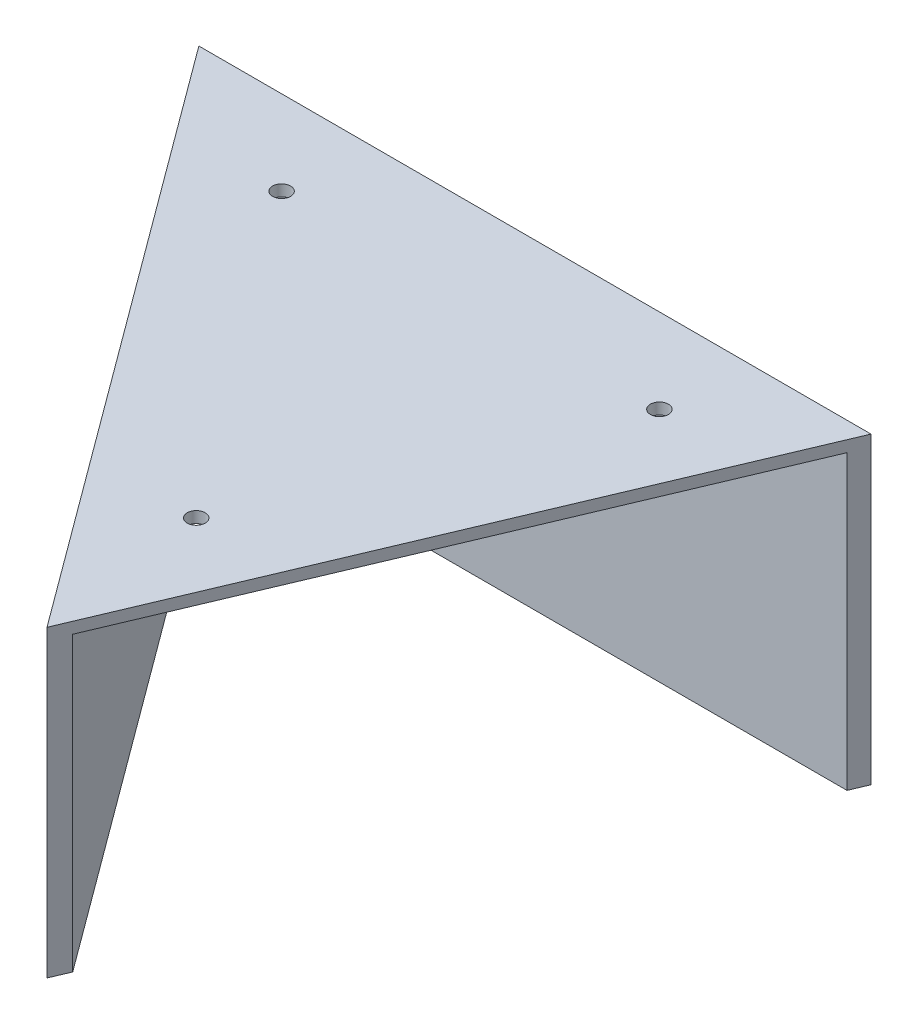
ISO-10303-21;
HEADER;
FILE_DESCRIPTION(('STEP AP214'),'2;1');
FILE_NAME('part.step','',(''),(''),'','','');
FILE_SCHEMA(('AUTOMOTIVE_DESIGN { 1 0 10303 214 1 1 1 1 }'));
ENDSEC;
DATA;
#1=APPLICATION_CONTEXT('core data for automotive mechanical design processes');
#2=APPLICATION_PROTOCOL_DEFINITION('international standard','automotive_design',2000,#1);
#3=PRODUCT_CONTEXT('',#1,'mechanical');
#4=PRODUCT('Part','Part','',(#3));
#5=PRODUCT_RELATED_PRODUCT_CATEGORY('part','',(#4));
#6=PRODUCT_DEFINITION_FORMATION('','',#4);
#7=PRODUCT_DEFINITION_CONTEXT('part definition',#1,'design');
#8=PRODUCT_DEFINITION('design','',#6,#7);
#9=PRODUCT_DEFINITION_SHAPE('','',#8);
#10=(LENGTH_UNIT() NAMED_UNIT(*) SI_UNIT(.MILLI.,.METRE.));
#11=(NAMED_UNIT(*) PLANE_ANGLE_UNIT() SI_UNIT($,.RADIAN.));
#12=(NAMED_UNIT(*) SI_UNIT($,.STERADIAN.) SOLID_ANGLE_UNIT());
#13=UNCERTAINTY_MEASURE_WITH_UNIT(LENGTH_MEASURE(1.E-05),#10,'distance_accuracy_value','');
#14=(GEOMETRIC_REPRESENTATION_CONTEXT(3) GLOBAL_UNCERTAINTY_ASSIGNED_CONTEXT((#13)) GLOBAL_UNIT_ASSIGNED_CONTEXT((#10,
#11,#12)) REPRESENTATION_CONTEXT('',''));
#15=CARTESIAN_POINT('',(0.,0.,0.));
#16=DIRECTION('',(0.,0.,1.));
#17=DIRECTION('',(1.,0.,0.));
#18=AXIS2_PLACEMENT_3D('',#15,#16,#17);
#19=CARTESIAN_POINT('',(6.50000000000002,2.,103.));
#20=DIRECTION('',(-0.921213947184014,0.,-0.389056375752472));
#21=DIRECTION('',(0.389056375752472,0.,-0.921213947184014));
#22=AXIS2_PLACEMENT_3D('',#19,#20,#21);
#23=PLANE('',#22);
#24=DIRECTION('',(0.389056375752472,0.,-0.921213947184014));
#25=VECTOR('',#24,1.);
#26=CARTESIAN_POINT('',(6.50000000000002,-52.,103.));
#27=LINE('',#26,#25);
#28=CARTESIAN_POINT('',(48.7330097087379,-52.,3.00000000000001));
#29=VERTEX_POINT('',#28);
#30=CARTESIAN_POINT('',(50.,-52.,0.));
#31=VERTEX_POINT('',#30);
#32=EDGE_CURVE('E96',#29,#31,#27,.T.);
#33=ORIENTED_EDGE('',*,*,#32,.T.);
#34=DIRECTION('',(0.,-1.,0.));
#35=VECTOR('',#34,1.);
#36=CARTESIAN_POINT('',(50.,2.,0.));
#37=LINE('',#36,#35);
#38=CARTESIAN_POINT('',(50.,2.,0.));
#39=VERTEX_POINT('',#38);
#40=EDGE_CURVE('E11',#39,#31,#37,.T.);
#41=ORIENTED_EDGE('',*,*,#40,.F.);
#42=DIRECTION('',(-0.389056375752472,0.,0.921213947184014));
#43=VECTOR('',#42,1.);
#44=CARTESIAN_POINT('',(6.50000000000002,2.,103.));
#45=LINE('',#44,#43);
#46=CARTESIAN_POINT('',(6.50000000000002,2.,103.));
#47=VERTEX_POINT('',#46);
#48=EDGE_CURVE('E114',#39,#47,#45,.T.);
#49=ORIENTED_EDGE('',*,*,#48,.T.);
#50=DIRECTION('',(0.,-1.,0.));
#51=VECTOR('',#50,1.);
#52=CARTESIAN_POINT('',(6.50000000000002,2.,103.));
#53=LINE('',#52,#51);
#54=CARTESIAN_POINT('',(6.50000000000002,-52.,103.));
#55=VERTEX_POINT('',#54);
#56=EDGE_CURVE('E39',#47,#55,#53,.T.);
#57=ORIENTED_EDGE('',*,*,#56,.T.);
#58=CARTESIAN_POINT('',(7.85715235470182,-52.,99.7865128153039));
#59=VERTEX_POINT('',#58);
#60=EDGE_CURVE('E104',#55,#59,#27,.T.);
#61=ORIENTED_EDGE('',*,*,#60,.T.);
#62=DIRECTION('',(0.,-1.,0.));
#63=VECTOR('',#62,1.);
#64=CARTESIAN_POINT('',(7.8571523547018,2.,99.7865128153038));
#65=LINE('',#64,#63);
#66=CARTESIAN_POINT('',(7.8571523547018,0.,99.7865128153038));
#67=VERTEX_POINT('',#66);
#68=EDGE_CURVE('E130',#67,#59,#65,.T.);
#69=ORIENTED_EDGE('',*,*,#68,.F.);
#70=DIRECTION('',(0.389056375752472,0.,-0.921213947184014));
#71=VECTOR('',#70,1.);
#72=CARTESIAN_POINT('',(6.50000000000002,0.,103.));
#73=LINE('',#72,#71);
#74=CARTESIAN_POINT('',(48.7330097087379,0.,3.00000000000002));
#75=VERTEX_POINT('',#74);
#76=EDGE_CURVE('E99',#67,#75,#73,.T.);
#77=ORIENTED_EDGE('',*,*,#76,.T.);
#78=DIRECTION('',(0.,-1.,0.));
#79=VECTOR('',#78,1.);
#80=CARTESIAN_POINT('',(48.7330097087379,113.00308109224,3.00000000000001));
#81=LINE('',#80,#79);
#82=EDGE_CURVE('E85',#75,#29,#81,.T.);
#83=ORIENTED_EDGE('',*,*,#82,.T.);
#84=EDGE_LOOP('',(#33,#41,#49,#57,#61,#69,#77,#83));
#85=FACE_BOUND('',#84,.T.);
#86=ADVANCED_FACE('F32',(#85),#23,.F.);
#87=CARTESIAN_POINT('',(6.50000000000002,2.,103.));
#88=DIRECTION('',(0.804662944010431,0.,-0.593731881017405));
#89=DIRECTION('',(0.593731881017406,0.,0.804662944010431));
#90=AXIS2_PLACEMENT_3D('',#87,#88,#89);
#91=PLANE('',#90);
#92=ORIENTED_EDGE('',*,*,#56,.F.);
#93=DIRECTION('',(-0.593731881017405,0.,-0.804662944010431));
#94=VECTOR('',#93,1.);
#95=CARTESIAN_POINT('',(6.50000000000002,2.,103.));
#96=LINE('',#95,#94);
#97=CARTESIAN_POINT('',(-69.5,2.,0.));
#98=VERTEX_POINT('',#97);
#99=EDGE_CURVE('E117',#47,#98,#96,.T.);
#100=ORIENTED_EDGE('',*,*,#99,.T.);
#101=DIRECTION('',(0.,-1.,0.));
#102=VECTOR('',#101,1.);
#103=CARTESIAN_POINT('',(-69.5,2.,0.));
#104=LINE('',#103,#102);
#105=CARTESIAN_POINT('',(-69.5,-52.,0.));
#106=VERTEX_POINT('',#105);
#107=EDGE_CURVE('E120',#98,#106,#104,.T.);
#108=ORIENTED_EDGE('',*,*,#107,.T.);
#109=DIRECTION('',(0.593731881017405,0.,0.804662944010431));
#110=VECTOR('',#109,1.);
#111=CARTESIAN_POINT('',(-69.5,-52.,0.));
#112=LINE('',#111,#110);
#113=EDGE_CURVE('E111',#106,#55,#112,.T.);
#114=ORIENTED_EDGE('',*,*,#113,.T.);
#115=EDGE_LOOP('',(#92,#100,#108,#114));
#116=FACE_BOUND('',#115,.T.);
#117=ADVANCED_FACE('F126',(#116),#91,.F.);
#118=CARTESIAN_POINT('',(0.,2.,0.));
#119=DIRECTION('',(0.,0.,1.));
#120=DIRECTION('',(-1.,0.,0.));
#121=AXIS2_PLACEMENT_3D('',#118,#119,#120);
#122=PLANE('',#121);
#123=ORIENTED_EDGE('',*,*,#107,.F.);
#124=DIRECTION('',(1.,0.,0.));
#125=VECTOR('',#124,1.);
#126=CARTESIAN_POINT('',(0.,2.,0.));
#127=LINE('',#126,#125);
#128=EDGE_CURVE('E54',#98,#39,#127,.T.);
#129=ORIENTED_EDGE('',*,*,#128,.T.);
#130=ORIENTED_EDGE('',*,*,#40,.T.);
#131=DIRECTION('',(-1.,0.,0.));
#132=VECTOR('',#131,1.);
#133=CARTESIAN_POINT('',(50.,-52.,0.));
#134=LINE('',#133,#132);
#135=EDGE_CURVE('E103',#31,#106,#134,.T.);
#136=ORIENTED_EDGE('',*,*,#135,.T.);
#137=EDGE_LOOP('',(#123,#129,#130,#136));
#138=FACE_BOUND('',#137,.T.);
#139=ADVANCED_FACE('F162',(#138),#122,.F.);
#140=CARTESIAN_POINT('',(0.,2.,0.));
#141=DIRECTION('',(0.,-1.,0.));
#142=DIRECTION('',(0.,0.,1.));
#143=AXIS2_PLACEMENT_3D('',#140,#141,#142);
#144=PLANE('',#143);
#145=CARTESIAN_POINT('',(-39.7906932732431,2.,15.));
#146=DIRECTION('',(0.,1.,0.));
#147=DIRECTION('',(0.,0.,1.));
#148=AXIS2_PLACEMENT_3D('',#145,#146,#147);
#149=CIRCLE('',#148,1.6);
#150=CARTESIAN_POINT('',(-39.7906932732431,2.,16.6));
#151=VERTEX_POINT('',#150);
#152=EDGE_CURVE('E152',#151,#151,#149,.T.);
#153=ORIENTED_EDGE('',*,*,#152,.F.);
#154=EDGE_LOOP('',(#153));
#155=FACE_BOUND('',#154,.T.);
#156=CARTESIAN_POINT('',(27.382186081769,2.,15.));
#157=DIRECTION('',(0.,1.,0.));
#158=DIRECTION('',(0.,0.,1.));
#159=AXIS2_PLACEMENT_3D('',#156,#157,#158);
#160=CIRCLE('',#159,1.6);
#161=CARTESIAN_POINT('',(27.382186081769,2.,16.6));
#162=VERTEX_POINT('',#161);
#163=EDGE_CURVE('E149',#162,#162,#160,.T.);
#164=ORIENTED_EDGE('',*,*,#163,.F.);
#165=EDGE_LOOP('',(#164));
#166=FACE_BOUND('',#165,.T.);
#167=CARTESIAN_POINT('',(2.93013376425416,2.,72.8979629587134));
#168=DIRECTION('',(0.,1.,0.));
#169=DIRECTION('',(0.,0.,1.));
#170=AXIS2_PLACEMENT_3D('',#167,#168,#169);
#171=CIRCLE('',#170,1.6);
#172=CARTESIAN_POINT('',(2.93013376425416,2.,74.4979629587134));
#173=VERTEX_POINT('',#172);
#174=EDGE_CURVE('E144',#173,#173,#171,.T.);
#175=ORIENTED_EDGE('',*,*,#174,.F.);
#176=EDGE_LOOP('',(#175));
#177=FACE_BOUND('',#176,.T.);
#178=ORIENTED_EDGE('',*,*,#128,.F.);
#179=ORIENTED_EDGE('',*,*,#99,.F.);
#180=ORIENTED_EDGE('',*,*,#48,.F.);
#181=EDGE_LOOP('',(#178,#179,#180));
#182=FACE_BOUND('',#181,.T.);
#183=ADVANCED_FACE('F159',(#155,#166,#177,#182),#144,.F.);
#184=CARTESIAN_POINT('',(0.,-52.,0.));
#185=DIRECTION('',(0.,-1.,0.));
#186=DIRECTION('',(0.,0.,1.));
#187=AXIS2_PLACEMENT_3D('',#184,#185,#186);
#188=PLANE('',#187);
#189=DIRECTION('',(-1.,0.,0.));
#190=VECTOR('',#189,1.);
#191=CARTESIAN_POINT('',(45.4764372163538,-52.,2.99999999999999));
#192=LINE('',#191,#190);
#193=CARTESIAN_POINT('',(-63.5581386546486,-52.,3.00000000000003));
#194=VERTEX_POINT('',#193);
#195=EDGE_CURVE('E82',#29,#194,#192,.T.);
#196=ORIENTED_EDGE('',*,*,#195,.T.);
#197=DIRECTION('',(0.593731881017405,0.,0.804662944010431));
#198=VECTOR('',#197,1.);
#199=CARTESIAN_POINT('',(-63.5581386546486,-52.,3.00000000000003));
#200=LINE('',#199,#198);
#201=EDGE_CURVE('E91',#194,#59,#200,.T.);
#202=ORIENTED_EDGE('',*,*,#201,.T.);
#203=ORIENTED_EDGE('',*,*,#60,.F.);
#204=ORIENTED_EDGE('',*,*,#113,.F.);
#205=ORIENTED_EDGE('',*,*,#135,.F.);
#206=ORIENTED_EDGE('',*,*,#32,.F.);
#207=EDGE_LOOP('',(#196,#202,#203,#204,#205,#206));
#208=FACE_BOUND('',#207,.T.);
#209=ADVANCED_FACE('F101',(#208),#188,.T.);
#210=CARTESIAN_POINT('',(-63.5581386546486,-52.,3.00000000000003));
#211=DIRECTION('',(0.804662944010431,0.,-0.593731881017405));
#212=DIRECTION('',(0.593731881017405,0.,0.804662944010431));
#213=AXIS2_PLACEMENT_3D('',#210,#211,#212);
#214=PLANE('',#213);
#215=DIRECTION('',(0.593731881017405,0.,0.804662944010431));
#216=VECTOR('',#215,1.);
#217=CARTESIAN_POINT('',(-63.5581386546486,0.,3.00000000000003));
#218=LINE('',#217,#216);
#219=CARTESIAN_POINT('',(-63.5581386546486,0.,3.00000000000003));
#220=VERTEX_POINT('',#219);
#221=EDGE_CURVE('E133',#220,#67,#218,.T.);
#222=ORIENTED_EDGE('',*,*,#221,.T.);
#223=ORIENTED_EDGE('',*,*,#68,.T.);
#224=ORIENTED_EDGE('',*,*,#201,.F.);
#225=DIRECTION('',(0.,1.,0.));
#226=VECTOR('',#225,1.);
#227=CARTESIAN_POINT('',(-63.5581386546486,-52.,3.00000000000003));
#228=LINE('',#227,#226);
#229=EDGE_CURVE('E87',#194,#220,#228,.T.);
#230=ORIENTED_EDGE('',*,*,#229,.T.);
#231=EDGE_LOOP('',(#222,#223,#224,#230));
#232=FACE_BOUND('',#231,.T.);
#233=ADVANCED_FACE('F131',(#232),#214,.T.);
#234=CARTESIAN_POINT('',(45.4764372163538,-52.,2.99999999999999));
#235=DIRECTION('',(0.,0.,1.));
#236=DIRECTION('',(-1.,0.,0.));
#237=AXIS2_PLACEMENT_3D('',#234,#235,#236);
#238=PLANE('',#237);
#239=DIRECTION('',(-1.,0.,0.));
#240=VECTOR('',#239,1.);
#241=CARTESIAN_POINT('',(45.4764372163538,0.,2.99999999999999));
#242=LINE('',#241,#240);
#243=EDGE_CURVE('E46',#75,#220,#242,.T.);
#244=ORIENTED_EDGE('',*,*,#243,.T.);
#245=ORIENTED_EDGE('',*,*,#229,.F.);
#246=ORIENTED_EDGE('',*,*,#195,.F.);
#247=ORIENTED_EDGE('',*,*,#82,.F.);
#248=EDGE_LOOP('',(#244,#245,#246,#247));
#249=FACE_BOUND('',#248,.T.);
#250=ADVANCED_FACE('F84',(#249),#238,.T.);
#251=CARTESIAN_POINT('',(0.,0.,0.));
#252=DIRECTION('',(0.,-1.,0.));
#253=DIRECTION('',(0.,0.,1.));
#254=AXIS2_PLACEMENT_3D('',#251,#252,#253);
#255=PLANE('',#254);
#256=CARTESIAN_POINT('',(-39.7906932732431,0.,15.));
#257=DIRECTION('',(0.,1.,0.));
#258=DIRECTION('',(0.,0.,1.));
#259=AXIS2_PLACEMENT_3D('',#256,#257,#258);
#260=CIRCLE('',#259,1.6);
#261=CARTESIAN_POINT('',(-39.7906932732431,0.,16.6));
#262=VERTEX_POINT('',#261);
#263=EDGE_CURVE('E141',#262,#262,#260,.T.);
#264=ORIENTED_EDGE('',*,*,#263,.T.);
#265=EDGE_LOOP('',(#264));
#266=FACE_BOUND('',#265,.T.);
#267=CARTESIAN_POINT('',(27.382186081769,0.,15.));
#268=DIRECTION('',(0.,1.,0.));
#269=DIRECTION('',(0.,0.,1.));
#270=AXIS2_PLACEMENT_3D('',#267,#268,#269);
#271=CIRCLE('',#270,1.6);
#272=CARTESIAN_POINT('',(27.382186081769,0.,16.6));
#273=VERTEX_POINT('',#272);
#274=EDGE_CURVE('E137',#273,#273,#271,.T.);
#275=ORIENTED_EDGE('',*,*,#274,.T.);
#276=EDGE_LOOP('',(#275));
#277=FACE_BOUND('',#276,.T.);
#278=CARTESIAN_POINT('',(2.93013376425416,0.,72.8979629587134));
#279=DIRECTION('',(0.,1.,0.));
#280=DIRECTION('',(0.,0.,1.));
#281=AXIS2_PLACEMENT_3D('',#278,#279,#280);
#282=CIRCLE('',#281,1.6);
#283=CARTESIAN_POINT('',(2.93013376425416,0.,74.4979629587134));
#284=VERTEX_POINT('',#283);
#285=EDGE_CURVE('E134',#284,#284,#282,.T.);
#286=ORIENTED_EDGE('',*,*,#285,.T.);
#287=EDGE_LOOP('',(#286));
#288=FACE_BOUND('',#287,.T.);
#289=ORIENTED_EDGE('',*,*,#221,.F.);
#290=ORIENTED_EDGE('',*,*,#243,.F.);
#291=ORIENTED_EDGE('',*,*,#76,.F.);
#292=EDGE_LOOP('',(#289,#290,#291));
#293=FACE_BOUND('',#292,.T.);
#294=ADVANCED_FACE('F171',(#266,#277,#288,#293),#255,.T.);
#295=CARTESIAN_POINT('',(2.93013376425416,52.,72.8979629587134));
#296=DIRECTION('',(0.,-1.,0.));
#297=DIRECTION('',(0.,0.,1.));
#298=AXIS2_PLACEMENT_3D('',#295,#296,#297);
#299=CYLINDRICAL_SURFACE('',#298,1.6);
#300=ORIENTED_EDGE('',*,*,#285,.F.);
#301=EDGE_LOOP('',(#300));
#302=FACE_BOUND('',#301,.T.);
#303=ORIENTED_EDGE('',*,*,#174,.T.);
#304=EDGE_LOOP('',(#303));
#305=FACE_BOUND('',#304,.T.);
#306=ADVANCED_FACE('F168',(#302,#305),#299,.F.);
#307=CARTESIAN_POINT('',(27.382186081769,52.,15.));
#308=DIRECTION('',(0.,-1.,0.));
#309=DIRECTION('',(0.,0.,1.));
#310=AXIS2_PLACEMENT_3D('',#307,#308,#309);
#311=CYLINDRICAL_SURFACE('',#310,1.6);
#312=ORIENTED_EDGE('',*,*,#274,.F.);
#313=EDGE_LOOP('',(#312));
#314=FACE_BOUND('',#313,.T.);
#315=ORIENTED_EDGE('',*,*,#163,.T.);
#316=EDGE_LOOP('',(#315));
#317=FACE_BOUND('',#316,.T.);
#318=ADVANCED_FACE('F170',(#314,#317),#311,.F.);
#319=CARTESIAN_POINT('',(-39.7906932732431,52.,15.));
#320=DIRECTION('',(0.,-1.,0.));
#321=DIRECTION('',(0.,0.,1.));
#322=AXIS2_PLACEMENT_3D('',#319,#320,#321);
#323=CYLINDRICAL_SURFACE('',#322,1.6);
#324=ORIENTED_EDGE('',*,*,#263,.F.);
#325=EDGE_LOOP('',(#324));
#326=FACE_BOUND('',#325,.T.);
#327=ORIENTED_EDGE('',*,*,#152,.T.);
#328=EDGE_LOOP('',(#327));
#329=FACE_BOUND('',#328,.T.);
#330=ADVANCED_FACE('F157',(#326,#329),#323,.F.);
#331=CLOSED_SHELL('',(#86,#117,#139,#183,#209,#233,#250,#294,#306,#318,#330));
#332=MANIFOLD_SOLID_BREP('B2',#331);
#333=ADVANCED_BREP_SHAPE_REPRESENTATION('',(#18,#332),#14);
#334=SHAPE_DEFINITION_REPRESENTATION(#9,#333);
ENDSEC;
END-ISO-10303-21;
